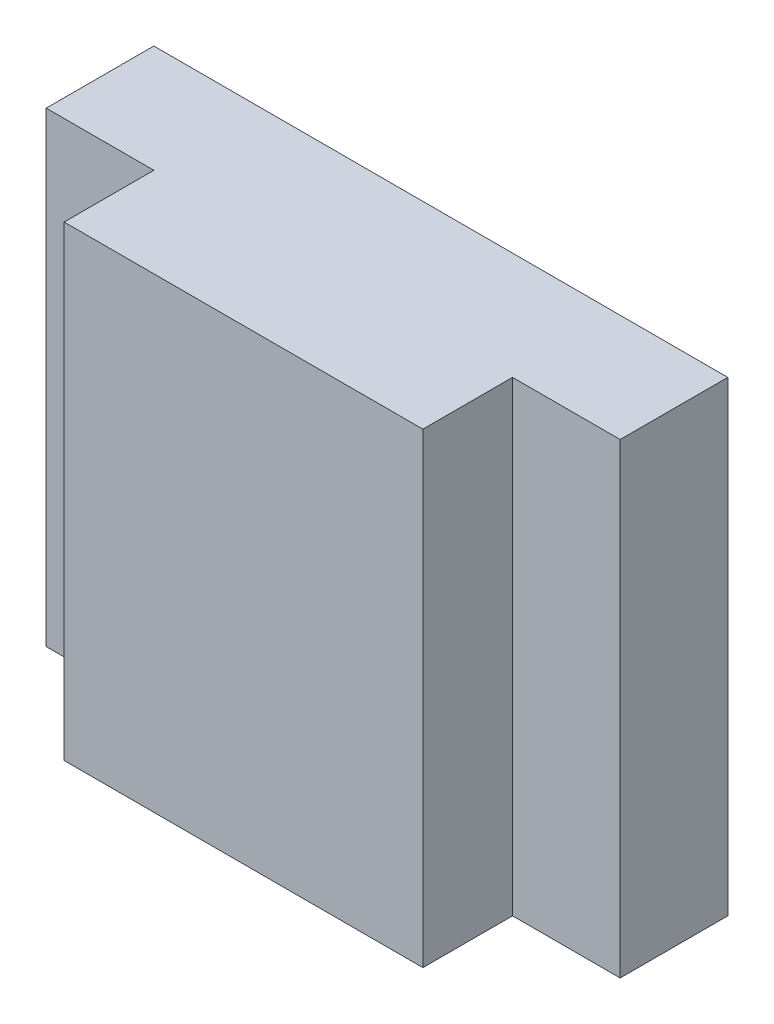
ISO-10303-21;
HEADER;
FILE_DESCRIPTION(('STEP AP214'),'2;1');
FILE_NAME('part.step','',(''),(''),'','','');
FILE_SCHEMA(('AUTOMOTIVE_DESIGN { 1 0 10303 214 1 1 1 1 }'));
ENDSEC;
DATA;
#1=APPLICATION_CONTEXT('core data for automotive mechanical design processes');
#2=APPLICATION_PROTOCOL_DEFINITION('international standard','automotive_design',2000,#1);
#3=PRODUCT_CONTEXT('',#1,'mechanical');
#4=PRODUCT('Part','Part','',(#3));
#5=PRODUCT_RELATED_PRODUCT_CATEGORY('part','',(#4));
#6=PRODUCT_DEFINITION_FORMATION('','',#4);
#7=PRODUCT_DEFINITION_CONTEXT('part definition',#1,'design');
#8=PRODUCT_DEFINITION('design','',#6,#7);
#9=PRODUCT_DEFINITION_SHAPE('','',#8);
#10=(LENGTH_UNIT() NAMED_UNIT(*) SI_UNIT(.MILLI.,.METRE.));
#11=(NAMED_UNIT(*) PLANE_ANGLE_UNIT() SI_UNIT($,.RADIAN.));
#12=(NAMED_UNIT(*) SI_UNIT($,.STERADIAN.) SOLID_ANGLE_UNIT());
#13=UNCERTAINTY_MEASURE_WITH_UNIT(LENGTH_MEASURE(1.E-05),#10,'distance_accuracy_value','');
#14=(GEOMETRIC_REPRESENTATION_CONTEXT(3) GLOBAL_UNCERTAINTY_ASSIGNED_CONTEXT((#13)) GLOBAL_UNIT_ASSIGNED_CONTEXT((#10,
#11,#12)) REPRESENTATION_CONTEXT('',''));
#15=CARTESIAN_POINT('',(0.,0.,0.));
#16=DIRECTION('',(0.,0.,1.));
#17=DIRECTION('',(1.,0.,0.));
#18=AXIS2_PLACEMENT_3D('',#15,#16,#17);
#19=CARTESIAN_POINT('',(1.,1.3,1.1));
#20=DIRECTION('',(-1.,0.,0.));
#21=DIRECTION('',(0.,-1.,0.));
#22=AXIS2_PLACEMENT_3D('',#19,#20,#21);
#23=PLANE('',#22);
#24=DIRECTION('',(0.,0.,1.));
#25=VECTOR('',#24,1.);
#26=CARTESIAN_POINT('',(1.,1.3,1.1));
#27=LINE('',#26,#25);
#28=CARTESIAN_POINT('',(1.,1.3,1.1));
#29=VERTEX_POINT('',#28);
#30=CARTESIAN_POINT('',(1.,1.3,0.6));
#31=VERTEX_POINT('',#30);
#32=EDGE_CURVE('E82',#29,#31,#27,.F.);
#33=ORIENTED_EDGE('',*,*,#32,.F.);
#34=DIRECTION('',(0.,1.,0.));
#35=VECTOR('',#34,1.);
#36=CARTESIAN_POINT('',(1.,0.,1.1));
#37=LINE('',#36,#35);
#38=CARTESIAN_POINT('',(1.,-1.3,1.1));
#39=VERTEX_POINT('',#38);
#40=EDGE_CURVE('E117',#39,#29,#37,.T.);
#41=ORIENTED_EDGE('',*,*,#40,.F.);
#42=DIRECTION('',(0.,0.,1.));
#43=VECTOR('',#42,1.);
#44=CARTESIAN_POINT('',(1.,-1.3,1.1));
#45=LINE('',#44,#43);
#46=CARTESIAN_POINT('',(1.,-1.3,0.6));
#47=VERTEX_POINT('',#46);
#48=EDGE_CURVE('E19',#47,#39,#45,.T.);
#49=ORIENTED_EDGE('',*,*,#48,.F.);
#50=DIRECTION('',(0.,1.,0.));
#51=VECTOR('',#50,1.);
#52=CARTESIAN_POINT('',(1.,0.,0.6));
#53=LINE('',#52,#51);
#54=EDGE_CURVE('E97',#31,#47,#53,.F.);
#55=ORIENTED_EDGE('',*,*,#54,.F.);
#56=EDGE_LOOP('',(#33,#41,#49,#55));
#57=FACE_BOUND('',#56,.T.);
#58=ADVANCED_FACE('F16',(#57),#23,.F.);
#59=CARTESIAN_POINT('',(-1.,1.3,1.1));
#60=DIRECTION('',(1.,0.,0.));
#61=DIRECTION('',(0.,1.,0.));
#62=AXIS2_PLACEMENT_3D('',#59,#60,#61);
#63=PLANE('',#62);
#64=DIRECTION('',(0.,0.,1.));
#65=VECTOR('',#64,1.);
#66=CARTESIAN_POINT('',(-1.,-1.3,1.1));
#67=LINE('',#66,#65);
#68=CARTESIAN_POINT('',(-1.,-1.3,1.1));
#69=VERTEX_POINT('',#68);
#70=CARTESIAN_POINT('',(-1.,-1.3,0.6));
#71=VERTEX_POINT('',#70);
#72=EDGE_CURVE('E77',#69,#71,#67,.F.);
#73=ORIENTED_EDGE('',*,*,#72,.F.);
#74=DIRECTION('',(0.,1.,0.));
#75=VECTOR('',#74,1.);
#76=CARTESIAN_POINT('',(-1.,0.,1.1));
#77=LINE('',#76,#75);
#78=CARTESIAN_POINT('',(-1.,1.3,1.1));
#79=VERTEX_POINT('',#78);
#80=EDGE_CURVE('E102',#79,#69,#77,.F.);
#81=ORIENTED_EDGE('',*,*,#80,.F.);
#82=DIRECTION('',(0.,0.,1.));
#83=VECTOR('',#82,1.);
#84=CARTESIAN_POINT('',(-1.,1.3,1.1));
#85=LINE('',#84,#83);
#86=CARTESIAN_POINT('',(-1.,1.3,0.6));
#87=VERTEX_POINT('',#86);
#88=EDGE_CURVE('E93',#87,#79,#85,.T.);
#89=ORIENTED_EDGE('',*,*,#88,.F.);
#90=DIRECTION('',(0.,1.,0.));
#91=VECTOR('',#90,1.);
#92=CARTESIAN_POINT('',(-1.,0.,0.6));
#93=LINE('',#92,#91);
#94=EDGE_CURVE('E136',#71,#87,#93,.T.);
#95=ORIENTED_EDGE('',*,*,#94,.F.);
#96=EDGE_LOOP('',(#73,#81,#89,#95));
#97=FACE_BOUND('',#96,.T.);
#98=ADVANCED_FACE('F114',(#97),#63,.F.);
#99=CARTESIAN_POINT('',(0.,0.,0.6));
#100=DIRECTION('',(0.,0.,1.));
#101=DIRECTION('',(1.,0.,0.));
#102=AXIS2_PLACEMENT_3D('',#99,#100,#101);
#103=PLANE('',#102);
#104=DIRECTION('',(0.,1.,0.));
#105=VECTOR('',#104,1.);
#106=CARTESIAN_POINT('',(1.6,1.3,0.6));
#107=LINE('',#106,#105);
#108=CARTESIAN_POINT('',(1.6,-1.3,0.6));
#109=VERTEX_POINT('',#108);
#110=CARTESIAN_POINT('',(1.6,1.3,0.6));
#111=VERTEX_POINT('',#110);
#112=EDGE_CURVE('E100',#109,#111,#107,.T.);
#113=ORIENTED_EDGE('',*,*,#112,.T.);
#114=DIRECTION('',(1.,0.,0.));
#115=VECTOR('',#114,1.);
#116=CARTESIAN_POINT('',(0.,1.3,0.6));
#117=LINE('',#116,#115);
#118=EDGE_CURVE('E85',#111,#31,#117,.F.);
#119=ORIENTED_EDGE('',*,*,#118,.T.);
#120=ORIENTED_EDGE('',*,*,#54,.T.);
#121=DIRECTION('',(1.,0.,0.));
#122=VECTOR('',#121,1.);
#123=CARTESIAN_POINT('',(-1.6,-1.3,0.6));
#124=LINE('',#123,#122);
#125=EDGE_CURVE('E129',#47,#109,#124,.T.);
#126=ORIENTED_EDGE('',*,*,#125,.T.);
#127=EDGE_LOOP('',(#113,#119,#120,#126));
#128=FACE_BOUND('',#127,.T.);
#129=ADVANCED_FACE('F96',(#128),#103,.T.);
#130=CARTESIAN_POINT('',(0.,0.,1.1));
#131=DIRECTION('',(0.,0.,1.));
#132=DIRECTION('',(1.,0.,0.));
#133=AXIS2_PLACEMENT_3D('',#130,#131,#132);
#134=PLANE('',#133);
#135=ORIENTED_EDGE('',*,*,#40,.T.);
#136=DIRECTION('',(1.,0.,0.));
#137=VECTOR('',#136,1.);
#138=CARTESIAN_POINT('',(-1.6,1.3,1.1));
#139=LINE('',#138,#137);
#140=EDGE_CURVE('E88',#29,#79,#139,.F.);
#141=ORIENTED_EDGE('',*,*,#140,.T.);
#142=ORIENTED_EDGE('',*,*,#80,.T.);
#143=DIRECTION('',(1.,0.,0.));
#144=VECTOR('',#143,1.);
#145=CARTESIAN_POINT('',(-1.6,-1.3,1.1));
#146=LINE('',#145,#144);
#147=EDGE_CURVE('E131',#69,#39,#146,.T.);
#148=ORIENTED_EDGE('',*,*,#147,.T.);
#149=EDGE_LOOP('',(#135,#141,#142,#148));
#150=FACE_BOUND('',#149,.T.);
#151=ADVANCED_FACE('F118',(#150),#134,.T.);
#152=CARTESIAN_POINT('',(0.,0.,0.6));
#153=DIRECTION('',(0.,0.,1.));
#154=DIRECTION('',(1.,0.,0.));
#155=AXIS2_PLACEMENT_3D('',#152,#153,#154);
#156=PLANE('',#155);
#157=DIRECTION('',(0.,1.,0.));
#158=VECTOR('',#157,1.);
#159=CARTESIAN_POINT('',(-1.6,1.3,0.6));
#160=LINE('',#159,#158);
#161=CARTESIAN_POINT('',(-1.6,1.3,0.6));
#162=VERTEX_POINT('',#161);
#163=CARTESIAN_POINT('',(-1.6,-1.3,0.6));
#164=VERTEX_POINT('',#163);
#165=EDGE_CURVE('E141',#162,#164,#160,.F.);
#166=ORIENTED_EDGE('',*,*,#165,.T.);
#167=DIRECTION('',(1.,0.,0.));
#168=VECTOR('',#167,1.);
#169=CARTESIAN_POINT('',(-1.6,-1.3,0.6));
#170=LINE('',#169,#168);
#171=EDGE_CURVE('E133',#164,#71,#170,.T.);
#172=ORIENTED_EDGE('',*,*,#171,.T.);
#173=ORIENTED_EDGE('',*,*,#94,.T.);
#174=DIRECTION('',(1.,0.,0.));
#175=VECTOR('',#174,1.);
#176=CARTESIAN_POINT('',(-1.6,1.3,0.6));
#177=LINE('',#176,#175);
#178=EDGE_CURVE('E110',#87,#162,#177,.F.);
#179=ORIENTED_EDGE('',*,*,#178,.T.);
#180=EDGE_LOOP('',(#166,#172,#173,#179));
#181=FACE_BOUND('',#180,.T.);
#182=ADVANCED_FACE('F140',(#181),#156,.T.);
#183=CARTESIAN_POINT('',(-1.6,-1.3,0.6));
#184=DIRECTION('',(0.,1.,0.));
#185=DIRECTION('',(0.,0.,1.));
#186=AXIS2_PLACEMENT_3D('',#183,#184,#185);
#187=PLANE('',#186);
#188=DIRECTION('',(0.,0.,1.));
#189=VECTOR('',#188,1.);
#190=CARTESIAN_POINT('',(1.6,-1.3,0.6));
#191=LINE('',#190,#189);
#192=CARTESIAN_POINT('',(1.6,-1.3,0.));
#193=VERTEX_POINT('',#192);
#194=EDGE_CURVE('E126',#193,#109,#191,.T.);
#195=ORIENTED_EDGE('',*,*,#194,.T.);
#196=ORIENTED_EDGE('',*,*,#125,.F.);
#197=ORIENTED_EDGE('',*,*,#48,.T.);
#198=ORIENTED_EDGE('',*,*,#147,.F.);
#199=ORIENTED_EDGE('',*,*,#72,.T.);
#200=ORIENTED_EDGE('',*,*,#171,.F.);
#201=DIRECTION('',(0.,0.,-1.));
#202=VECTOR('',#201,1.);
#203=CARTESIAN_POINT('',(-1.6,-1.3,0.6));
#204=LINE('',#203,#202);
#205=CARTESIAN_POINT('',(-1.6,-1.3,0.));
#206=VERTEX_POINT('',#205);
#207=EDGE_CURVE('E146',#164,#206,#204,.T.);
#208=ORIENTED_EDGE('',*,*,#207,.T.);
#209=DIRECTION('',(1.,0.,0.));
#210=VECTOR('',#209,1.);
#211=CARTESIAN_POINT('',(0.,-1.3,0.));
#212=LINE('',#211,#210);
#213=EDGE_CURVE('E148',#206,#193,#212,.T.);
#214=ORIENTED_EDGE('',*,*,#213,.T.);
#215=EDGE_LOOP('',(#195,#196,#197,#198,#199,#200,#208,#214));
#216=FACE_BOUND('',#215,.T.);
#217=ADVANCED_FACE('F144',(#216),#187,.F.);
#218=CARTESIAN_POINT('',(1.6,1.3,0.6));
#219=DIRECTION('',(-1.,0.,0.));
#220=DIRECTION('',(0.,0.,1.));
#221=AXIS2_PLACEMENT_3D('',#218,#219,#220);
#222=PLANE('',#221);
#223=DIRECTION('',(0.,0.,-1.));
#224=VECTOR('',#223,1.);
#225=CARTESIAN_POINT('',(1.6,1.3,0.6));
#226=LINE('',#225,#224);
#227=CARTESIAN_POINT('',(1.6,1.3,0.));
#228=VERTEX_POINT('',#227);
#229=EDGE_CURVE('E119',#228,#111,#226,.F.);
#230=ORIENTED_EDGE('',*,*,#229,.T.);
#231=ORIENTED_EDGE('',*,*,#112,.F.);
#232=ORIENTED_EDGE('',*,*,#194,.F.);
#233=DIRECTION('',(0.,1.,0.));
#234=VECTOR('',#233,1.);
#235=CARTESIAN_POINT('',(1.6,0.,0.));
#236=LINE('',#235,#234);
#237=EDGE_CURVE('E150',#193,#228,#236,.T.);
#238=ORIENTED_EDGE('',*,*,#237,.T.);
#239=EDGE_LOOP('',(#230,#231,#232,#238));
#240=FACE_BOUND('',#239,.T.);
#241=ADVANCED_FACE('F161',(#240),#222,.F.);
#242=CARTESIAN_POINT('',(-1.6,1.3,0.6));
#243=DIRECTION('',(0.,-1.,0.));
#244=DIRECTION('',(0.,0.,-1.));
#245=AXIS2_PLACEMENT_3D('',#242,#243,#244);
#246=PLANE('',#245);
#247=DIRECTION('',(0.,0.,-1.));
#248=VECTOR('',#247,1.);
#249=CARTESIAN_POINT('',(-1.6,1.3,0.6));
#250=LINE('',#249,#248);
#251=CARTESIAN_POINT('',(-1.6,1.3,0.));
#252=VERTEX_POINT('',#251);
#253=EDGE_CURVE('E33',#252,#162,#250,.F.);
#254=ORIENTED_EDGE('',*,*,#253,.T.);
#255=ORIENTED_EDGE('',*,*,#178,.F.);
#256=ORIENTED_EDGE('',*,*,#88,.T.);
#257=ORIENTED_EDGE('',*,*,#140,.F.);
#258=ORIENTED_EDGE('',*,*,#32,.T.);
#259=ORIENTED_EDGE('',*,*,#118,.F.);
#260=ORIENTED_EDGE('',*,*,#229,.F.);
#261=DIRECTION('',(1.,0.,0.));
#262=VECTOR('',#261,1.);
#263=CARTESIAN_POINT('',(0.,1.3,0.));
#264=LINE('',#263,#262);
#265=EDGE_CURVE('E25',#228,#252,#264,.F.);
#266=ORIENTED_EDGE('',*,*,#265,.T.);
#267=EDGE_LOOP('',(#254,#255,#256,#257,#258,#259,#260,#266));
#268=FACE_BOUND('',#267,.T.);
#269=ADVANCED_FACE('F84',(#268),#246,.F.);
#270=CARTESIAN_POINT('',(-1.6,1.3,0.6));
#271=DIRECTION('',(1.,0.,0.));
#272=DIRECTION('',(0.,0.,-1.));
#273=AXIS2_PLACEMENT_3D('',#270,#271,#272);
#274=PLANE('',#273);
#275=ORIENTED_EDGE('',*,*,#207,.F.);
#276=ORIENTED_EDGE('',*,*,#165,.F.);
#277=ORIENTED_EDGE('',*,*,#253,.F.);
#278=DIRECTION('',(0.,1.,0.));
#279=VECTOR('',#278,1.);
#280=CARTESIAN_POINT('',(-1.6,0.,0.));
#281=LINE('',#280,#279);
#282=EDGE_CURVE('E11',#252,#206,#281,.F.);
#283=ORIENTED_EDGE('',*,*,#282,.T.);
#284=EDGE_LOOP('',(#275,#276,#277,#283));
#285=FACE_BOUND('',#284,.T.);
#286=ADVANCED_FACE('F147',(#285),#274,.F.);
#287=CARTESIAN_POINT('',(0.,0.,0.));
#288=DIRECTION('',(0.,0.,1.));
#289=DIRECTION('',(1.,0.,0.));
#290=AXIS2_PLACEMENT_3D('',#287,#288,#289);
#291=PLANE('',#290);
#292=ORIENTED_EDGE('',*,*,#265,.F.);
#293=ORIENTED_EDGE('',*,*,#237,.F.);
#294=ORIENTED_EDGE('',*,*,#213,.F.);
#295=ORIENTED_EDGE('',*,*,#282,.F.);
#296=EDGE_LOOP('',(#292,#293,#294,#295));
#297=FACE_BOUND('',#296,.T.);
#298=ADVANCED_FACE('F162',(#297),#291,.F.);
#299=CLOSED_SHELL('',(#58,#98,#129,#151,#182,#217,#241,#269,#286,#298));
#300=MANIFOLD_SOLID_BREP('B1',#299);
#301=ADVANCED_BREP_SHAPE_REPRESENTATION('',(#18,#300),#14);
#302=SHAPE_DEFINITION_REPRESENTATION(#9,#301);
ENDSEC;
END-ISO-10303-21;
